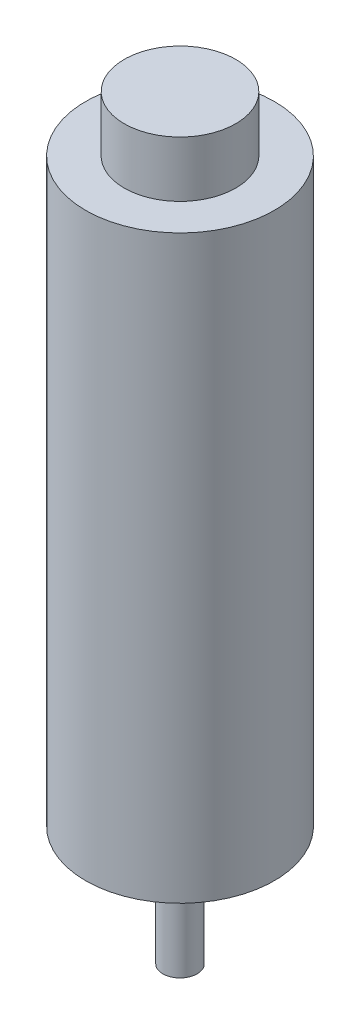
ISO-10303-21;
HEADER;
FILE_DESCRIPTION(('STEP AP214'),'2;1');
FILE_NAME('part.step','',(''),(''),'','','');
FILE_SCHEMA(('AUTOMOTIVE_DESIGN { 1 0 10303 214 1 1 1 1 }'));
ENDSEC;
DATA;
#1=APPLICATION_CONTEXT('core data for automotive mechanical design processes');
#2=APPLICATION_PROTOCOL_DEFINITION('international standard','automotive_design',2000,#1);
#3=PRODUCT_CONTEXT('',#1,'mechanical');
#4=PRODUCT('Part','Part','',(#3));
#5=PRODUCT_RELATED_PRODUCT_CATEGORY('part','',(#4));
#6=PRODUCT_DEFINITION_FORMATION('','',#4);
#7=PRODUCT_DEFINITION_CONTEXT('part definition',#1,'design');
#8=PRODUCT_DEFINITION('design','',#6,#7);
#9=PRODUCT_DEFINITION_SHAPE('','',#8);
#10=(LENGTH_UNIT() NAMED_UNIT(*) SI_UNIT(.MILLI.,.METRE.));
#11=(NAMED_UNIT(*) PLANE_ANGLE_UNIT() SI_UNIT($,.RADIAN.));
#12=(NAMED_UNIT(*) SI_UNIT($,.STERADIAN.) SOLID_ANGLE_UNIT());
#13=UNCERTAINTY_MEASURE_WITH_UNIT(LENGTH_MEASURE(1.E-05),#10,'distance_accuracy_value','');
#14=(GEOMETRIC_REPRESENTATION_CONTEXT(3) GLOBAL_UNCERTAINTY_ASSIGNED_CONTEXT((#13)) GLOBAL_UNIT_ASSIGNED_CONTEXT((#10,
#11,#12)) REPRESENTATION_CONTEXT('',''));
#15=CARTESIAN_POINT('',(0.,0.,0.));
#16=DIRECTION('',(0.,0.,1.));
#17=DIRECTION('',(1.,0.,0.));
#18=AXIS2_PLACEMENT_3D('',#15,#16,#17);
#19=CARTESIAN_POINT('',(0.,33.835,0.));
#20=DIRECTION('',(0.,-1.,0.));
#21=DIRECTION('',(0.,0.,-1.));
#22=AXIS2_PLACEMENT_3D('',#19,#20,#21);
#23=CYLINDRICAL_SURFACE('',#22,11.);
#24=CARTESIAN_POINT('',(0.,33.835,0.));
#25=DIRECTION('',(0.,1.,0.));
#26=DIRECTION('',(0.,0.,1.));
#27=AXIS2_PLACEMENT_3D('',#24,#25,#26);
#28=CIRCLE('',#27,11.);
#29=CARTESIAN_POINT('',(0.,33.835,11.));
#30=VERTEX_POINT('',#29);
#31=EDGE_CURVE('E77',#30,#30,#28,.T.);
#32=ORIENTED_EDGE('',*,*,#31,.F.);
#33=EDGE_LOOP('',(#32));
#34=FACE_BOUND('',#33,.T.);
#35=CARTESIAN_POINT('',(0.,-33.835,0.));
#36=DIRECTION('',(0.,1.,0.));
#37=DIRECTION('',(0.,0.,1.));
#38=AXIS2_PLACEMENT_3D('',#35,#36,#37);
#39=CIRCLE('',#38,11.);
#40=CARTESIAN_POINT('',(0.,-33.835,11.));
#41=VERTEX_POINT('',#40);
#42=EDGE_CURVE('E50',#41,#41,#39,.T.);
#43=ORIENTED_EDGE('',*,*,#42,.T.);
#44=EDGE_LOOP('',(#43));
#45=FACE_BOUND('',#44,.T.);
#46=ADVANCED_FACE('F47',(#34,#45),#23,.T.);
#47=CARTESIAN_POINT('',(0.,33.835,0.));
#48=DIRECTION('',(0.,1.,0.));
#49=DIRECTION('',(0.,0.,1.));
#50=AXIS2_PLACEMENT_3D('',#47,#48,#49);
#51=PLANE('',#50);
#52=CARTESIAN_POINT('',(0.,33.835,0.));
#53=DIRECTION('',(0.,1.,0.));
#54=DIRECTION('',(0.,0.,1.));
#55=AXIS2_PLACEMENT_3D('',#52,#53,#54);
#56=CIRCLE('',#55,6.5);
#57=CARTESIAN_POINT('',(0.,33.835,6.5));
#58=VERTEX_POINT('',#57);
#59=EDGE_CURVE('E73',#58,#58,#56,.T.);
#60=ORIENTED_EDGE('',*,*,#59,.F.);
#61=EDGE_LOOP('',(#60));
#62=FACE_BOUND('',#61,.T.);
#63=ORIENTED_EDGE('',*,*,#31,.T.);
#64=EDGE_LOOP('',(#63));
#65=FACE_BOUND('',#64,.T.);
#66=ADVANCED_FACE('F88',(#62,#65),#51,.T.);
#67=CARTESIAN_POINT('',(0.,-33.835,0.));
#68=DIRECTION('',(0.,1.,0.));
#69=DIRECTION('',(0.,0.,1.));
#70=AXIS2_PLACEMENT_3D('',#67,#68,#69);
#71=PLANE('',#70);
#72=CARTESIAN_POINT('',(0.,-33.835,0.));
#73=DIRECTION('',(0.,-1.,0.));
#74=DIRECTION('',(0.,0.,-1.));
#75=AXIS2_PLACEMENT_3D('',#72,#73,#74);
#76=CIRCLE('',#75,5.);
#77=CARTESIAN_POINT('',(0.,-33.835,-5.));
#78=VERTEX_POINT('',#77);
#79=EDGE_CURVE('E59',#78,#78,#76,.T.);
#80=ORIENTED_EDGE('',*,*,#79,.F.);
#81=EDGE_LOOP('',(#80));
#82=FACE_BOUND('',#81,.T.);
#83=ORIENTED_EDGE('',*,*,#42,.F.);
#84=EDGE_LOOP('',(#83));
#85=FACE_BOUND('',#84,.T.);
#86=ADVANCED_FACE('F85',(#82,#85),#71,.F.);
#87=CARTESIAN_POINT('',(0.,40.335,0.));
#88=DIRECTION('',(0.,-1.,0.));
#89=DIRECTION('',(0.,0.,-1.));
#90=AXIS2_PLACEMENT_3D('',#87,#88,#89);
#91=CYLINDRICAL_SURFACE('',#90,6.5);
#92=CARTESIAN_POINT('',(0.,40.335,0.));
#93=DIRECTION('',(0.,1.,0.));
#94=DIRECTION('',(0.,0.,1.));
#95=AXIS2_PLACEMENT_3D('',#92,#93,#94);
#96=CIRCLE('',#95,6.5);
#97=CARTESIAN_POINT('',(0.,40.335,6.5));
#98=VERTEX_POINT('',#97);
#99=EDGE_CURVE('E70',#98,#98,#96,.T.);
#100=ORIENTED_EDGE('',*,*,#99,.F.);
#101=EDGE_LOOP('',(#100));
#102=FACE_BOUND('',#101,.T.);
#103=ORIENTED_EDGE('',*,*,#59,.T.);
#104=EDGE_LOOP('',(#103));
#105=FACE_BOUND('',#104,.T.);
#106=ADVANCED_FACE('F87',(#102,#105),#91,.T.);
#107=CARTESIAN_POINT('',(0.,40.335,0.));
#108=DIRECTION('',(0.,1.,0.));
#109=DIRECTION('',(0.,0.,1.));
#110=AXIS2_PLACEMENT_3D('',#107,#108,#109);
#111=PLANE('',#110);
#112=ORIENTED_EDGE('',*,*,#99,.T.);
#113=EDGE_LOOP('',(#112));
#114=FACE_BOUND('',#113,.T.);
#115=ADVANCED_FACE('F95',(#114),#111,.T.);
#116=CARTESIAN_POINT('',(0.,-34.835,0.));
#117=DIRECTION('',(0.,1.,0.));
#118=DIRECTION('',(0.,0.,1.));
#119=AXIS2_PLACEMENT_3D('',#116,#117,#118);
#120=CYLINDRICAL_SURFACE('',#119,5.);
#121=CARTESIAN_POINT('',(0.,-34.835,0.));
#122=DIRECTION('',(0.,-1.,0.));
#123=DIRECTION('',(0.,0.,-1.));
#124=AXIS2_PLACEMENT_3D('',#121,#122,#123);
#125=CIRCLE('',#124,5.);
#126=CARTESIAN_POINT('',(0.,-34.835,-5.));
#127=VERTEX_POINT('',#126);
#128=EDGE_CURVE('E66',#127,#127,#125,.T.);
#129=ORIENTED_EDGE('',*,*,#128,.F.);
#130=EDGE_LOOP('',(#129));
#131=FACE_BOUND('',#130,.T.);
#132=ORIENTED_EDGE('',*,*,#79,.T.);
#133=EDGE_LOOP('',(#132));
#134=FACE_BOUND('',#133,.T.);
#135=ADVANCED_FACE('F121',(#131,#134),#120,.T.);
#136=CARTESIAN_POINT('',(0.,-34.835,0.));
#137=DIRECTION('',(0.,-1.,0.));
#138=DIRECTION('',(0.,0.,-1.));
#139=AXIS2_PLACEMENT_3D('',#136,#137,#138);
#140=PLANE('',#139);
#141=CARTESIAN_POINT('',(0.,-34.835,0.));
#142=DIRECTION('',(0.,-1.,0.));
#143=DIRECTION('',(0.,0.,-1.));
#144=AXIS2_PLACEMENT_3D('',#141,#142,#143);
#145=CIRCLE('',#144,3.5);
#146=CARTESIAN_POINT('',(0.,-34.835,-3.5));
#147=VERTEX_POINT('',#146);
#148=EDGE_CURVE('E54',#147,#147,#145,.T.);
#149=ORIENTED_EDGE('',*,*,#148,.F.);
#150=EDGE_LOOP('',(#149));
#151=FACE_BOUND('',#150,.T.);
#152=ORIENTED_EDGE('',*,*,#128,.T.);
#153=EDGE_LOOP('',(#152));
#154=FACE_BOUND('',#153,.T.);
#155=ADVANCED_FACE('F133',(#151,#154),#140,.T.);
#156=CARTESIAN_POINT('',(0.,-36.835,0.));
#157=DIRECTION('',(0.,1.,0.));
#158=DIRECTION('',(0.,0.,1.));
#159=AXIS2_PLACEMENT_3D('',#156,#157,#158);
#160=CYLINDRICAL_SURFACE('',#159,3.5);
#161=CARTESIAN_POINT('',(0.,-36.835,0.));
#162=DIRECTION('',(0.,-1.,0.));
#163=DIRECTION('',(0.,0.,-1.));
#164=AXIS2_PLACEMENT_3D('',#161,#162,#163);
#165=CIRCLE('',#164,3.5);
#166=CARTESIAN_POINT('',(0.,-36.835,-3.5));
#167=VERTEX_POINT('',#166);
#168=EDGE_CURVE('E64',#167,#167,#165,.T.);
#169=ORIENTED_EDGE('',*,*,#168,.F.);
#170=EDGE_LOOP('',(#169));
#171=FACE_BOUND('',#170,.T.);
#172=ORIENTED_EDGE('',*,*,#148,.T.);
#173=EDGE_LOOP('',(#172));
#174=FACE_BOUND('',#173,.T.);
#175=ADVANCED_FACE('F143',(#171,#174),#160,.T.);
#176=CARTESIAN_POINT('',(0.,-36.835,0.));
#177=DIRECTION('',(0.,-1.,0.));
#178=DIRECTION('',(0.,0.,-1.));
#179=AXIS2_PLACEMENT_3D('',#176,#177,#178);
#180=PLANE('',#179);
#181=CARTESIAN_POINT('',(0.,-36.835,0.));
#182=DIRECTION('',(0.,-1.,0.));
#183=DIRECTION('',(0.,0.,-1.));
#184=AXIS2_PLACEMENT_3D('',#181,#182,#183);
#185=CIRCLE('',#184,2.);
#186=CARTESIAN_POINT('',(0.,-36.835,-2.));
#187=VERTEX_POINT('',#186);
#188=EDGE_CURVE('E10',#187,#187,#185,.T.);
#189=ORIENTED_EDGE('',*,*,#188,.F.);
#190=EDGE_LOOP('',(#189));
#191=FACE_BOUND('',#190,.T.);
#192=ORIENTED_EDGE('',*,*,#168,.T.);
#193=EDGE_LOOP('',(#192));
#194=FACE_BOUND('',#193,.T.);
#195=ADVANCED_FACE('F153',(#191,#194),#180,.T.);
#196=CARTESIAN_POINT('',(0.,-47.735,0.));
#197=DIRECTION('',(0.,1.,0.));
#198=DIRECTION('',(0.,0.,1.));
#199=AXIS2_PLACEMENT_3D('',#196,#197,#198);
#200=CYLINDRICAL_SURFACE('',#199,2.);
#201=CARTESIAN_POINT('',(0.,-47.735,0.));
#202=DIRECTION('',(0.,-1.,0.));
#203=DIRECTION('',(0.,0.,-1.));
#204=AXIS2_PLACEMENT_3D('',#201,#202,#203);
#205=CIRCLE('',#204,2.);
#206=CARTESIAN_POINT('',(0.,-47.735,-2.));
#207=VERTEX_POINT('',#206);
#208=EDGE_CURVE('E63',#207,#207,#205,.T.);
#209=ORIENTED_EDGE('',*,*,#208,.F.);
#210=EDGE_LOOP('',(#209));
#211=FACE_BOUND('',#210,.T.);
#212=ORIENTED_EDGE('',*,*,#188,.T.);
#213=EDGE_LOOP('',(#212));
#214=FACE_BOUND('',#213,.T.);
#215=ADVANCED_FACE('F163',(#211,#214),#200,.T.);
#216=CARTESIAN_POINT('',(0.,-47.735,0.));
#217=DIRECTION('',(0.,-1.,0.));
#218=DIRECTION('',(0.,0.,-1.));
#219=AXIS2_PLACEMENT_3D('',#216,#217,#218);
#220=PLANE('',#219);
#221=ORIENTED_EDGE('',*,*,#208,.T.);
#222=EDGE_LOOP('',(#221));
#223=FACE_BOUND('',#222,.T.);
#224=ADVANCED_FACE('F173',(#223),#220,.T.);
#225=CLOSED_SHELL('',(#46,#66,#86,#106,#115,#135,#155,#175,#195,#215,#224));
#226=MANIFOLD_SOLID_BREP('B2',#225);
#227=ADVANCED_BREP_SHAPE_REPRESENTATION('',(#18,#226),#14);
#228=SHAPE_DEFINITION_REPRESENTATION(#9,#227);
ENDSEC;
END-ISO-10303-21;
